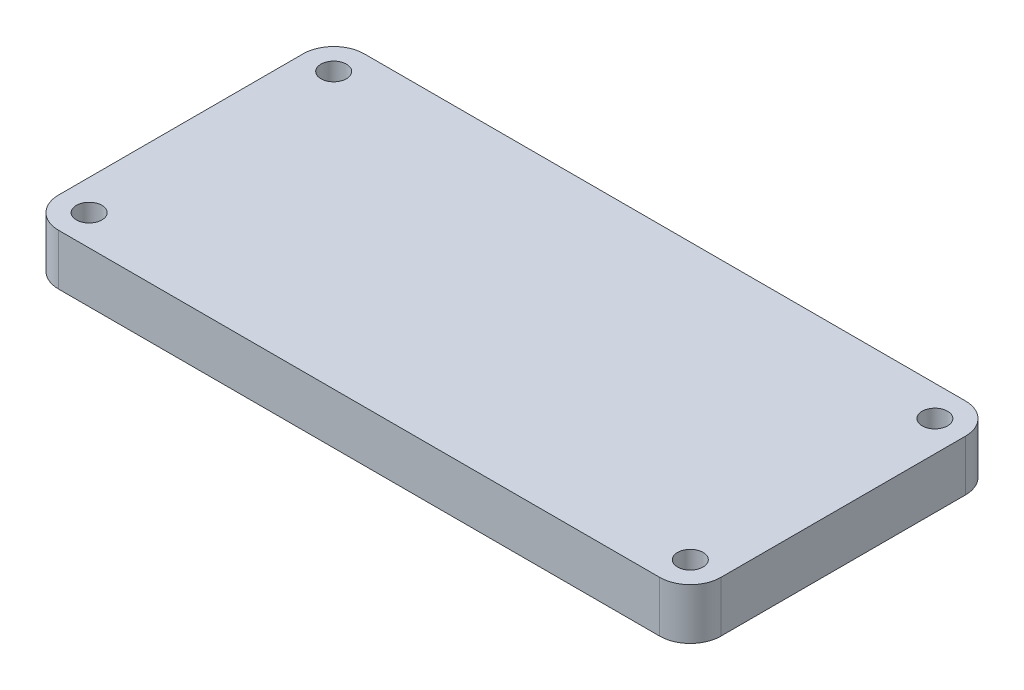
ISO-10303-21;
HEADER;
FILE_DESCRIPTION(('STEP AP214'),'2;1');
FILE_NAME('part.step','',(''),(''),'','','');
FILE_SCHEMA(('AUTOMOTIVE_DESIGN { 1 0 10303 214 1 1 1 1 }'));
ENDSEC;
DATA;
#1=APPLICATION_CONTEXT('core data for automotive mechanical design processes');
#2=APPLICATION_PROTOCOL_DEFINITION('international standard','automotive_design',2000,#1);
#3=PRODUCT_CONTEXT('',#1,'mechanical');
#4=PRODUCT('Part','Part','',(#3));
#5=PRODUCT_RELATED_PRODUCT_CATEGORY('part','',(#4));
#6=PRODUCT_DEFINITION_FORMATION('','',#4);
#7=PRODUCT_DEFINITION_CONTEXT('part definition',#1,'design');
#8=PRODUCT_DEFINITION('design','',#6,#7);
#9=PRODUCT_DEFINITION_SHAPE('','',#8);
#10=(LENGTH_UNIT() NAMED_UNIT(*) SI_UNIT(.MILLI.,.METRE.));
#11=(NAMED_UNIT(*) PLANE_ANGLE_UNIT() SI_UNIT($,.RADIAN.));
#12=(NAMED_UNIT(*) SI_UNIT($,.STERADIAN.) SOLID_ANGLE_UNIT());
#13=UNCERTAINTY_MEASURE_WITH_UNIT(LENGTH_MEASURE(1.E-05),#10,'distance_accuracy_value','');
#14=(GEOMETRIC_REPRESENTATION_CONTEXT(3) GLOBAL_UNCERTAINTY_ASSIGNED_CONTEXT((#13)) GLOBAL_UNIT_ASSIGNED_CONTEXT((#10,
#11,#12)) REPRESENTATION_CONTEXT('',''));
#15=CARTESIAN_POINT('',(0.,0.,0.));
#16=DIRECTION('',(0.,0.,1.));
#17=DIRECTION('',(1.,0.,0.));
#18=AXIS2_PLACEMENT_3D('',#15,#16,#17);
#19=CARTESIAN_POINT('',(29.5,5.,-12.));
#20=DIRECTION('',(0.,-1.,0.));
#21=DIRECTION('',(0.,0.,-1.));
#22=AXIS2_PLACEMENT_3D('',#19,#20,#21);
#23=PLANE('',#22);
#24=CARTESIAN_POINT('',(29.5,5.,-12.));
#25=DIRECTION('',(0.,1.,0.));
#26=DIRECTION('',(0.,0.,-1.));
#27=AXIS2_PLACEMENT_3D('',#24,#25,#26);
#28=CIRCLE('',#27,3.);
#29=CARTESIAN_POINT('',(32.5,5.,-12.));
#30=VERTEX_POINT('',#29);
#31=CARTESIAN_POINT('',(29.5,5.,-15.));
#32=VERTEX_POINT('',#31);
#33=EDGE_CURVE('E146',#30,#32,#28,.T.);
#34=ORIENTED_EDGE('',*,*,#33,.T.);
#35=DIRECTION('',(-1.,0.,0.));
#36=VECTOR('',#35,1.);
#37=CARTESIAN_POINT('',(-29.5,5.,-15.));
#38=LINE('',#37,#36);
#39=CARTESIAN_POINT('',(-29.5,5.,-15.));
#40=VERTEX_POINT('',#39);
#41=EDGE_CURVE('E94',#32,#40,#38,.T.);
#42=ORIENTED_EDGE('',*,*,#41,.T.);
#43=CARTESIAN_POINT('',(-29.5,5.,-12.));
#44=DIRECTION('',(0.,1.,0.));
#45=DIRECTION('',(0.,0.,-1.));
#46=AXIS2_PLACEMENT_3D('',#43,#44,#45);
#47=CIRCLE('',#46,3.);
#48=CARTESIAN_POINT('',(-32.5,5.,-12.));
#49=VERTEX_POINT('',#48);
#50=EDGE_CURVE('E161',#40,#49,#47,.T.);
#51=ORIENTED_EDGE('',*,*,#50,.T.);
#52=DIRECTION('',(0.,0.,1.));
#53=VECTOR('',#52,1.);
#54=CARTESIAN_POINT('',(-32.5,5.,12.));
#55=LINE('',#54,#53);
#56=CARTESIAN_POINT('',(-32.5,5.,12.));
#57=VERTEX_POINT('',#56);
#58=EDGE_CURVE('E174',#49,#57,#55,.T.);
#59=ORIENTED_EDGE('',*,*,#58,.T.);
#60=CARTESIAN_POINT('',(-29.5,5.,12.));
#61=DIRECTION('',(0.,1.,0.));
#62=DIRECTION('',(0.,0.,-1.));
#63=AXIS2_PLACEMENT_3D('',#60,#61,#62);
#64=CIRCLE('',#63,3.);
#65=CARTESIAN_POINT('',(-29.5,5.,15.));
#66=VERTEX_POINT('',#65);
#67=EDGE_CURVE('E113',#57,#66,#64,.T.);
#68=ORIENTED_EDGE('',*,*,#67,.T.);
#69=DIRECTION('',(1.,0.,0.));
#70=VECTOR('',#69,1.);
#71=CARTESIAN_POINT('',(-29.5,5.,15.));
#72=LINE('',#71,#70);
#73=CARTESIAN_POINT('',(29.5,5.,15.));
#74=VERTEX_POINT('',#73);
#75=EDGE_CURVE('E107',#66,#74,#72,.T.);
#76=ORIENTED_EDGE('',*,*,#75,.T.);
#77=CARTESIAN_POINT('',(29.5,5.,12.));
#78=DIRECTION('',(0.,1.,0.));
#79=DIRECTION('',(0.,0.,-1.));
#80=AXIS2_PLACEMENT_3D('',#77,#78,#79);
#81=CIRCLE('',#80,3.);
#82=CARTESIAN_POINT('',(32.5,5.,12.));
#83=VERTEX_POINT('',#82);
#84=EDGE_CURVE('E111',#74,#83,#81,.T.);
#85=ORIENTED_EDGE('',*,*,#84,.T.);
#86=DIRECTION('',(0.,0.,-1.));
#87=VECTOR('',#86,1.);
#88=CARTESIAN_POINT('',(32.5,5.,12.));
#89=LINE('',#88,#87);
#90=EDGE_CURVE('E51',#83,#30,#89,.T.);
#91=ORIENTED_EDGE('',*,*,#90,.T.);
#92=EDGE_LOOP('',(#34,#42,#51,#59,#68,#76,#85,#91));
#93=FACE_BOUND('',#92,.T.);
#94=CARTESIAN_POINT('',(-29.5,5.,-12.));
#95=DIRECTION('',(0.,1.,0.));
#96=DIRECTION('',(0.,0.,1.));
#97=AXIS2_PLACEMENT_3D('',#94,#95,#96);
#98=CIRCLE('',#97,1.25);
#99=CARTESIAN_POINT('',(-29.5,5.,-10.75));
#100=VERTEX_POINT('',#99);
#101=EDGE_CURVE('E135',#100,#100,#98,.T.);
#102=ORIENTED_EDGE('',*,*,#101,.F.);
#103=EDGE_LOOP('',(#102));
#104=FACE_BOUND('',#103,.T.);
#105=CARTESIAN_POINT('',(29.5,5.,-12.));
#106=DIRECTION('',(0.,1.,0.));
#107=DIRECTION('',(0.,0.,-1.));
#108=AXIS2_PLACEMENT_3D('',#105,#106,#107);
#109=CIRCLE('',#108,1.25);
#110=CARTESIAN_POINT('',(29.5,5.,-13.25));
#111=VERTEX_POINT('',#110);
#112=EDGE_CURVE('E183',#111,#111,#109,.T.);
#113=ORIENTED_EDGE('',*,*,#112,.F.);
#114=EDGE_LOOP('',(#113));
#115=FACE_BOUND('',#114,.T.);
#116=CARTESIAN_POINT('',(29.5,5.,12.));
#117=DIRECTION('',(0.,1.,0.));
#118=DIRECTION('',(0.,0.,1.));
#119=AXIS2_PLACEMENT_3D('',#116,#117,#118);
#120=CIRCLE('',#119,1.25);
#121=CARTESIAN_POINT('',(29.5,5.,13.25));
#122=VERTEX_POINT('',#121);
#123=EDGE_CURVE('E189',#122,#122,#120,.T.);
#124=ORIENTED_EDGE('',*,*,#123,.F.);
#125=EDGE_LOOP('',(#124));
#126=FACE_BOUND('',#125,.T.);
#127=CARTESIAN_POINT('',(-29.5,5.,12.));
#128=DIRECTION('',(0.,1.,0.));
#129=DIRECTION('',(0.,0.,-1.));
#130=AXIS2_PLACEMENT_3D('',#127,#128,#129);
#131=CIRCLE('',#130,1.25);
#132=CARTESIAN_POINT('',(-29.5,5.,10.75));
#133=VERTEX_POINT('',#132);
#134=EDGE_CURVE('E195',#133,#133,#131,.T.);
#135=ORIENTED_EDGE('',*,*,#134,.F.);
#136=EDGE_LOOP('',(#135));
#137=FACE_BOUND('',#136,.T.);
#138=ADVANCED_FACE('F34',(#93,#104,#115,#126,#137),#23,.F.);
#139=CARTESIAN_POINT('',(29.5,0.,-12.));
#140=DIRECTION('',(0.,-1.,0.));
#141=DIRECTION('',(0.,0.,-1.));
#142=AXIS2_PLACEMENT_3D('',#139,#140,#141);
#143=PLANE('',#142);
#144=CARTESIAN_POINT('',(29.5,0.,12.));
#145=DIRECTION('',(0.,1.,0.));
#146=DIRECTION('',(0.,0.,1.));
#147=AXIS2_PLACEMENT_3D('',#144,#145,#146);
#148=CIRCLE('',#147,1.25);
#149=CARTESIAN_POINT('',(29.5,0.,13.25));
#150=VERTEX_POINT('',#149);
#151=EDGE_CURVE('E192',#150,#150,#148,.T.);
#152=ORIENTED_EDGE('',*,*,#151,.T.);
#153=EDGE_LOOP('',(#152));
#154=FACE_BOUND('',#153,.T.);
#155=CARTESIAN_POINT('',(-29.5,0.,-12.));
#156=DIRECTION('',(0.,1.,0.));
#157=DIRECTION('',(0.,0.,1.));
#158=AXIS2_PLACEMENT_3D('',#155,#156,#157);
#159=CIRCLE('',#158,1.25);
#160=CARTESIAN_POINT('',(-29.5,0.,-10.75));
#161=VERTEX_POINT('',#160);
#162=EDGE_CURVE('E180',#161,#161,#159,.T.);
#163=ORIENTED_EDGE('',*,*,#162,.T.);
#164=EDGE_LOOP('',(#163));
#165=FACE_BOUND('',#164,.T.);
#166=CARTESIAN_POINT('',(29.5,0.,-12.));
#167=DIRECTION('',(0.,1.,0.));
#168=DIRECTION('',(0.,0.,-1.));
#169=AXIS2_PLACEMENT_3D('',#166,#167,#168);
#170=CIRCLE('',#169,3.);
#171=CARTESIAN_POINT('',(32.5,0.,-12.));
#172=VERTEX_POINT('',#171);
#173=CARTESIAN_POINT('',(29.5,0.,-15.));
#174=VERTEX_POINT('',#173);
#175=EDGE_CURVE('E131',#172,#174,#170,.T.);
#176=ORIENTED_EDGE('',*,*,#175,.F.);
#177=DIRECTION('',(0.,0.,-1.));
#178=VECTOR('',#177,1.);
#179=CARTESIAN_POINT('',(32.5,0.,12.));
#180=LINE('',#179,#178);
#181=CARTESIAN_POINT('',(32.5,0.,12.));
#182=VERTEX_POINT('',#181);
#183=EDGE_CURVE('E86',#182,#172,#180,.T.);
#184=ORIENTED_EDGE('',*,*,#183,.F.);
#185=CARTESIAN_POINT('',(29.5,0.,12.));
#186=DIRECTION('',(0.,1.,0.));
#187=DIRECTION('',(0.,0.,-1.));
#188=AXIS2_PLACEMENT_3D('',#185,#186,#187);
#189=CIRCLE('',#188,3.);
#190=CARTESIAN_POINT('',(29.5,0.,15.));
#191=VERTEX_POINT('',#190);
#192=EDGE_CURVE('E80',#191,#182,#189,.T.);
#193=ORIENTED_EDGE('',*,*,#192,.F.);
#194=DIRECTION('',(1.,0.,0.));
#195=VECTOR('',#194,1.);
#196=CARTESIAN_POINT('',(-29.5,0.,15.));
#197=LINE('',#196,#195);
#198=CARTESIAN_POINT('',(-29.5,0.,15.));
#199=VERTEX_POINT('',#198);
#200=EDGE_CURVE('E121',#199,#191,#197,.T.);
#201=ORIENTED_EDGE('',*,*,#200,.F.);
#202=CARTESIAN_POINT('',(-29.5,0.,12.));
#203=DIRECTION('',(0.,1.,0.));
#204=DIRECTION('',(0.,0.,-1.));
#205=AXIS2_PLACEMENT_3D('',#202,#203,#204);
#206=CIRCLE('',#205,3.);
#207=CARTESIAN_POINT('',(-32.5,0.,12.));
#208=VERTEX_POINT('',#207);
#209=EDGE_CURVE('E141',#208,#199,#206,.T.);
#210=ORIENTED_EDGE('',*,*,#209,.F.);
#211=DIRECTION('',(0.,0.,1.));
#212=VECTOR('',#211,1.);
#213=CARTESIAN_POINT('',(-32.5,0.,12.));
#214=LINE('',#213,#212);
#215=CARTESIAN_POINT('',(-32.5,0.,-12.));
#216=VERTEX_POINT('',#215);
#217=EDGE_CURVE('E139',#216,#208,#214,.T.);
#218=ORIENTED_EDGE('',*,*,#217,.F.);
#219=CARTESIAN_POINT('',(-29.5,0.,-12.));
#220=DIRECTION('',(0.,1.,0.));
#221=DIRECTION('',(0.,0.,-1.));
#222=AXIS2_PLACEMENT_3D('',#219,#220,#221);
#223=CIRCLE('',#222,3.);
#224=CARTESIAN_POINT('',(-29.5,0.,-15.));
#225=VERTEX_POINT('',#224);
#226=EDGE_CURVE('E137',#225,#216,#223,.T.);
#227=ORIENTED_EDGE('',*,*,#226,.F.);
#228=DIRECTION('',(-1.,0.,0.));
#229=VECTOR('',#228,1.);
#230=CARTESIAN_POINT('',(-29.5,0.,-15.));
#231=LINE('',#230,#229);
#232=EDGE_CURVE('E134',#174,#225,#231,.T.);
#233=ORIENTED_EDGE('',*,*,#232,.F.);
#234=EDGE_LOOP('',(#176,#184,#193,#201,#210,#218,#227,#233));
#235=FACE_BOUND('',#234,.T.);
#236=CARTESIAN_POINT('',(29.5,0.,-12.));
#237=DIRECTION('',(0.,1.,0.));
#238=DIRECTION('',(0.,0.,-1.));
#239=AXIS2_PLACEMENT_3D('',#236,#237,#238);
#240=CIRCLE('',#239,1.25);
#241=CARTESIAN_POINT('',(29.5,0.,-13.25));
#242=VERTEX_POINT('',#241);
#243=EDGE_CURVE('E186',#242,#242,#240,.T.);
#244=ORIENTED_EDGE('',*,*,#243,.T.);
#245=EDGE_LOOP('',(#244));
#246=FACE_BOUND('',#245,.T.);
#247=CARTESIAN_POINT('',(-29.5,0.,12.));
#248=DIRECTION('',(0.,1.,0.));
#249=DIRECTION('',(0.,0.,-1.));
#250=AXIS2_PLACEMENT_3D('',#247,#248,#249);
#251=CIRCLE('',#250,1.25);
#252=CARTESIAN_POINT('',(-29.5,0.,10.75));
#253=VERTEX_POINT('',#252);
#254=EDGE_CURVE('E198',#253,#253,#251,.T.);
#255=ORIENTED_EDGE('',*,*,#254,.T.);
#256=EDGE_LOOP('',(#255));
#257=FACE_BOUND('',#256,.T.);
#258=ADVANCED_FACE('F165',(#154,#165,#235,#246,#257),#143,.T.);
#259=CARTESIAN_POINT('',(29.5,5.,-12.));
#260=DIRECTION('',(0.,-1.,0.));
#261=DIRECTION('',(0.,0.,-1.));
#262=AXIS2_PLACEMENT_3D('',#259,#260,#261);
#263=CYLINDRICAL_SURFACE('',#262,3.);
#264=ORIENTED_EDGE('',*,*,#175,.T.);
#265=DIRECTION('',(0.,-1.,0.));
#266=VECTOR('',#265,1.);
#267=CARTESIAN_POINT('',(29.5,5.,-15.));
#268=LINE('',#267,#266);
#269=EDGE_CURVE('E11',#32,#174,#268,.T.);
#270=ORIENTED_EDGE('',*,*,#269,.F.);
#271=ORIENTED_EDGE('',*,*,#33,.F.);
#272=DIRECTION('',(0.,-1.,0.));
#273=VECTOR('',#272,1.);
#274=CARTESIAN_POINT('',(32.5,5.,-12.));
#275=LINE('',#274,#273);
#276=EDGE_CURVE('E127',#30,#172,#275,.T.);
#277=ORIENTED_EDGE('',*,*,#276,.T.);
#278=EDGE_LOOP('',(#264,#270,#271,#277));
#279=FACE_BOUND('',#278,.T.);
#280=ADVANCED_FACE('F36',(#279),#263,.T.);
#281=CARTESIAN_POINT('',(-29.5,5.,-15.));
#282=DIRECTION('',(0.,0.,1.));
#283=DIRECTION('',(1.,0.,0.));
#284=AXIS2_PLACEMENT_3D('',#281,#282,#283);
#285=PLANE('',#284);
#286=ORIENTED_EDGE('',*,*,#232,.T.);
#287=DIRECTION('',(0.,-1.,0.));
#288=VECTOR('',#287,1.);
#289=CARTESIAN_POINT('',(-29.5,5.,-15.));
#290=LINE('',#289,#288);
#291=EDGE_CURVE('E43',#40,#225,#290,.T.);
#292=ORIENTED_EDGE('',*,*,#291,.F.);
#293=ORIENTED_EDGE('',*,*,#41,.F.);
#294=ORIENTED_EDGE('',*,*,#269,.T.);
#295=EDGE_LOOP('',(#286,#292,#293,#294));
#296=FACE_BOUND('',#295,.T.);
#297=ADVANCED_FACE('F230',(#296),#285,.F.);
#298=CARTESIAN_POINT('',(-29.5,5.,-12.));
#299=DIRECTION('',(0.,-1.,0.));
#300=DIRECTION('',(0.,0.,-1.));
#301=AXIS2_PLACEMENT_3D('',#298,#299,#300);
#302=CYLINDRICAL_SURFACE('',#301,3.);
#303=ORIENTED_EDGE('',*,*,#226,.T.);
#304=DIRECTION('',(0.,-1.,0.));
#305=VECTOR('',#304,1.);
#306=CARTESIAN_POINT('',(-32.5,5.,-12.));
#307=LINE('',#306,#305);
#308=EDGE_CURVE('E153',#49,#216,#307,.T.);
#309=ORIENTED_EDGE('',*,*,#308,.F.);
#310=ORIENTED_EDGE('',*,*,#50,.F.);
#311=ORIENTED_EDGE('',*,*,#291,.T.);
#312=EDGE_LOOP('',(#303,#309,#310,#311));
#313=FACE_BOUND('',#312,.T.);
#314=ADVANCED_FACE('F159',(#313),#302,.T.);
#315=CARTESIAN_POINT('',(-32.5,5.,12.));
#316=DIRECTION('',(1.,0.,0.));
#317=DIRECTION('',(0.,0.,-1.));
#318=AXIS2_PLACEMENT_3D('',#315,#316,#317);
#319=PLANE('',#318);
#320=ORIENTED_EDGE('',*,*,#217,.T.);
#321=DIRECTION('',(0.,-1.,0.));
#322=VECTOR('',#321,1.);
#323=CARTESIAN_POINT('',(-32.5,5.,12.));
#324=LINE('',#323,#322);
#325=EDGE_CURVE('E150',#57,#208,#324,.T.);
#326=ORIENTED_EDGE('',*,*,#325,.F.);
#327=ORIENTED_EDGE('',*,*,#58,.F.);
#328=ORIENTED_EDGE('',*,*,#308,.T.);
#329=EDGE_LOOP('',(#320,#326,#327,#328));
#330=FACE_BOUND('',#329,.T.);
#331=ADVANCED_FACE('F170',(#330),#319,.F.);
#332=CARTESIAN_POINT('',(-29.5,5.,12.));
#333=DIRECTION('',(0.,-1.,0.));
#334=DIRECTION('',(0.,0.,-1.));
#335=AXIS2_PLACEMENT_3D('',#332,#333,#334);
#336=CYLINDRICAL_SURFACE('',#335,3.);
#337=ORIENTED_EDGE('',*,*,#209,.T.);
#338=DIRECTION('',(0.,-1.,0.));
#339=VECTOR('',#338,1.);
#340=CARTESIAN_POINT('',(-29.5,5.,15.));
#341=LINE('',#340,#339);
#342=EDGE_CURVE('E122',#66,#199,#341,.T.);
#343=ORIENTED_EDGE('',*,*,#342,.F.);
#344=ORIENTED_EDGE('',*,*,#67,.F.);
#345=ORIENTED_EDGE('',*,*,#325,.T.);
#346=EDGE_LOOP('',(#337,#343,#344,#345));
#347=FACE_BOUND('',#346,.T.);
#348=ADVANCED_FACE('F173',(#347),#336,.T.);
#349=CARTESIAN_POINT('',(-29.5,5.,15.));
#350=DIRECTION('',(0.,0.,-1.));
#351=DIRECTION('',(-1.,0.,0.));
#352=AXIS2_PLACEMENT_3D('',#349,#350,#351);
#353=PLANE('',#352);
#354=ORIENTED_EDGE('',*,*,#200,.T.);
#355=DIRECTION('',(0.,-1.,0.));
#356=VECTOR('',#355,1.);
#357=CARTESIAN_POINT('',(29.5,5.,15.));
#358=LINE('',#357,#356);
#359=EDGE_CURVE('E118',#74,#191,#358,.T.);
#360=ORIENTED_EDGE('',*,*,#359,.F.);
#361=ORIENTED_EDGE('',*,*,#75,.F.);
#362=ORIENTED_EDGE('',*,*,#342,.T.);
#363=EDGE_LOOP('',(#354,#360,#361,#362));
#364=FACE_BOUND('',#363,.T.);
#365=ADVANCED_FACE('F119',(#364),#353,.F.);
#366=CARTESIAN_POINT('',(29.5,5.,12.));
#367=DIRECTION('',(0.,-1.,0.));
#368=DIRECTION('',(0.,0.,-1.));
#369=AXIS2_PLACEMENT_3D('',#366,#367,#368);
#370=CYLINDRICAL_SURFACE('',#369,3.);
#371=ORIENTED_EDGE('',*,*,#192,.T.);
#372=DIRECTION('',(0.,-1.,0.));
#373=VECTOR('',#372,1.);
#374=CARTESIAN_POINT('',(32.5,5.,12.));
#375=LINE('',#374,#373);
#376=EDGE_CURVE('E123',#83,#182,#375,.T.);
#377=ORIENTED_EDGE('',*,*,#376,.F.);
#378=ORIENTED_EDGE('',*,*,#84,.F.);
#379=ORIENTED_EDGE('',*,*,#359,.T.);
#380=EDGE_LOOP('',(#371,#377,#378,#379));
#381=FACE_BOUND('',#380,.T.);
#382=ADVANCED_FACE('F125',(#381),#370,.T.);
#383=CARTESIAN_POINT('',(32.5,5.,12.));
#384=DIRECTION('',(-1.,0.,0.));
#385=DIRECTION('',(0.,0.,1.));
#386=AXIS2_PLACEMENT_3D('',#383,#384,#385);
#387=PLANE('',#386);
#388=ORIENTED_EDGE('',*,*,#183,.T.);
#389=ORIENTED_EDGE('',*,*,#276,.F.);
#390=ORIENTED_EDGE('',*,*,#90,.F.);
#391=ORIENTED_EDGE('',*,*,#376,.T.);
#392=EDGE_LOOP('',(#388,#389,#390,#391));
#393=FACE_BOUND('',#392,.T.);
#394=ADVANCED_FACE('F218',(#393),#387,.F.);
#395=CARTESIAN_POINT('',(-29.5,5.,-12.));
#396=DIRECTION('',(0.,-1.,0.));
#397=DIRECTION('',(0.,0.,-1.));
#398=AXIS2_PLACEMENT_3D('',#395,#396,#397);
#399=CYLINDRICAL_SURFACE('',#398,1.25);
#400=ORIENTED_EDGE('',*,*,#101,.T.);
#401=EDGE_LOOP('',(#400));
#402=FACE_BOUND('',#401,.T.);
#403=ORIENTED_EDGE('',*,*,#162,.F.);
#404=EDGE_LOOP('',(#403));
#405=FACE_BOUND('',#404,.T.);
#406=ADVANCED_FACE('F215',(#402,#405),#399,.F.);
#407=CARTESIAN_POINT('',(29.5,5.,-12.));
#408=DIRECTION('',(0.,-1.,0.));
#409=DIRECTION('',(0.,0.,-1.));
#410=AXIS2_PLACEMENT_3D('',#407,#408,#409);
#411=CYLINDRICAL_SURFACE('',#410,1.25);
#412=ORIENTED_EDGE('',*,*,#112,.T.);
#413=EDGE_LOOP('',(#412));
#414=FACE_BOUND('',#413,.T.);
#415=ORIENTED_EDGE('',*,*,#243,.F.);
#416=EDGE_LOOP('',(#415));
#417=FACE_BOUND('',#416,.T.);
#418=ADVANCED_FACE('F294',(#414,#417),#411,.F.);
#419=CARTESIAN_POINT('',(29.5,5.,12.));
#420=DIRECTION('',(0.,-1.,0.));
#421=DIRECTION('',(0.,0.,-1.));
#422=AXIS2_PLACEMENT_3D('',#419,#420,#421);
#423=CYLINDRICAL_SURFACE('',#422,1.25);
#424=ORIENTED_EDGE('',*,*,#123,.T.);
#425=EDGE_LOOP('',(#424));
#426=FACE_BOUND('',#425,.T.);
#427=ORIENTED_EDGE('',*,*,#151,.F.);
#428=EDGE_LOOP('',(#427));
#429=FACE_BOUND('',#428,.T.);
#430=ADVANCED_FACE('F302',(#426,#429),#423,.F.);
#431=CARTESIAN_POINT('',(-29.5,5.,12.));
#432=DIRECTION('',(0.,-1.,0.));
#433=DIRECTION('',(0.,0.,-1.));
#434=AXIS2_PLACEMENT_3D('',#431,#432,#433);
#435=CYLINDRICAL_SURFACE('',#434,1.25);
#436=ORIENTED_EDGE('',*,*,#134,.T.);
#437=EDGE_LOOP('',(#436));
#438=FACE_BOUND('',#437,.T.);
#439=ORIENTED_EDGE('',*,*,#254,.F.);
#440=EDGE_LOOP('',(#439));
#441=FACE_BOUND('',#440,.T.);
#442=ADVANCED_FACE('F204',(#438,#441),#435,.F.);
#443=CLOSED_SHELL('',(#138,#258,#280,#297,#314,#331,#348,#365,#382,#394,#406,#418,#430,#442));
#444=MANIFOLD_SOLID_BREP('B2',#443);
#445=ADVANCED_BREP_SHAPE_REPRESENTATION('',(#18,#444),#14);
#446=SHAPE_DEFINITION_REPRESENTATION(#9,#445);
ENDSEC;
END-ISO-10303-21;
